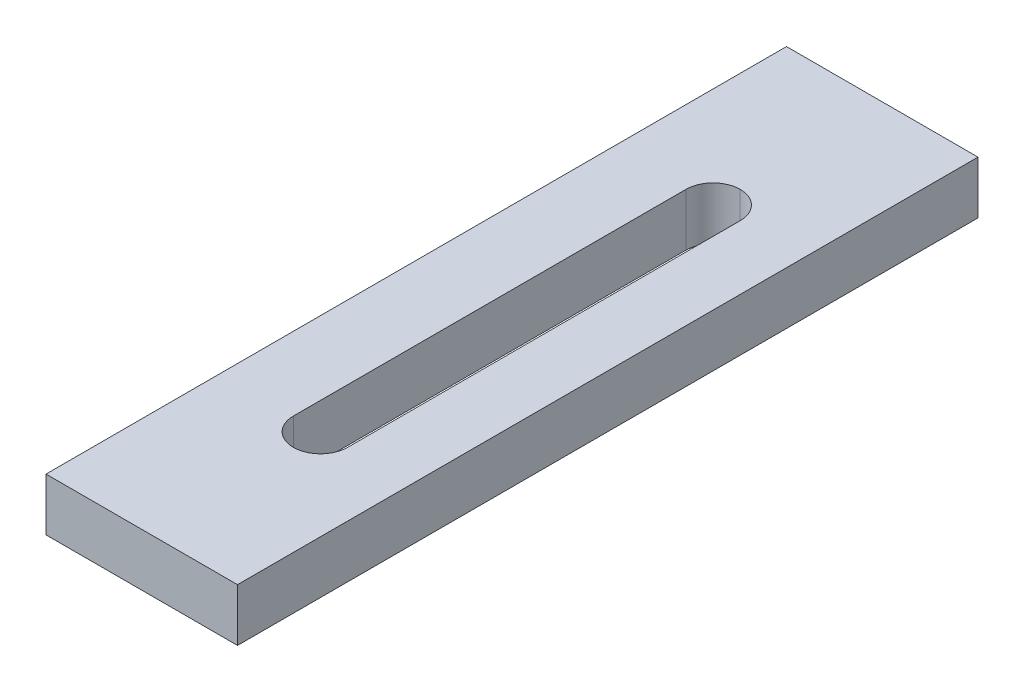
ISO-10303-21;
HEADER;
FILE_DESCRIPTION(('STEP AP214'),'2;1');
FILE_NAME('part.step','',(''),(''),'','','');
FILE_SCHEMA(('AUTOMOTIVE_DESIGN { 1 0 10303 214 1 1 1 1 }'));
ENDSEC;
DATA;
#1=APPLICATION_CONTEXT('core data for automotive mechanical design processes');
#2=APPLICATION_PROTOCOL_DEFINITION('international standard','automotive_design',2000,#1);
#3=PRODUCT_CONTEXT('',#1,'mechanical');
#4=PRODUCT('Part','Part','',(#3));
#5=PRODUCT_RELATED_PRODUCT_CATEGORY('part','',(#4));
#6=PRODUCT_DEFINITION_FORMATION('','',#4);
#7=PRODUCT_DEFINITION_CONTEXT('part definition',#1,'design');
#8=PRODUCT_DEFINITION('design','',#6,#7);
#9=PRODUCT_DEFINITION_SHAPE('','',#8);
#10=(LENGTH_UNIT() NAMED_UNIT(*) SI_UNIT(.MILLI.,.METRE.));
#11=(NAMED_UNIT(*) PLANE_ANGLE_UNIT() SI_UNIT($,.RADIAN.));
#12=(NAMED_UNIT(*) SI_UNIT($,.STERADIAN.) SOLID_ANGLE_UNIT());
#13=UNCERTAINTY_MEASURE_WITH_UNIT(LENGTH_MEASURE(1.E-05),#10,'distance_accuracy_value','');
#14=(GEOMETRIC_REPRESENTATION_CONTEXT(3) GLOBAL_UNCERTAINTY_ASSIGNED_CONTEXT((#13)) GLOBAL_UNIT_ASSIGNED_CONTEXT((#10,
#11,#12)) REPRESENTATION_CONTEXT('',''));
#15=CARTESIAN_POINT('',(0.,0.,0.));
#16=DIRECTION('',(0.,0.,1.));
#17=DIRECTION('',(1.,0.,0.));
#18=AXIS2_PLACEMENT_3D('',#15,#16,#17);
#19=CARTESIAN_POINT('',(-3.,-0.825,0.));
#20=DIRECTION('',(1.,0.,0.));
#21=DIRECTION('',(0.,0.,-1.));
#22=AXIS2_PLACEMENT_3D('',#19,#20,#21);
#23=PLANE('',#22);
#24=DIRECTION('',(0.,0.,-1.));
#25=VECTOR('',#24,1.);
#26=CARTESIAN_POINT('',(-3.,0.825,0.));
#27=LINE('',#26,#25);
#28=CARTESIAN_POINT('',(-3.,0.825,11.6));
#29=VERTEX_POINT('',#28);
#30=CARTESIAN_POINT('',(-3.,0.825,-11.6));
#31=VERTEX_POINT('',#30);
#32=EDGE_CURVE('E152',#29,#31,#27,.T.);
#33=ORIENTED_EDGE('',*,*,#32,.T.);
#34=DIRECTION('',(0.,1.,0.));
#35=VECTOR('',#34,1.);
#36=CARTESIAN_POINT('',(-3.,-0.825,-11.6));
#37=LINE('',#36,#35);
#38=CARTESIAN_POINT('',(-3.,-0.825,-11.6));
#39=VERTEX_POINT('',#38);
#40=EDGE_CURVE('E132',#39,#31,#37,.T.);
#41=ORIENTED_EDGE('',*,*,#40,.F.);
#42=DIRECTION('',(0.,0.,-1.));
#43=VECTOR('',#42,1.);
#44=CARTESIAN_POINT('',(-3.,-0.825,0.));
#45=LINE('',#44,#43);
#46=CARTESIAN_POINT('',(-3.,-0.825,11.6));
#47=VERTEX_POINT('',#46);
#48=EDGE_CURVE('E130',#47,#39,#45,.T.);
#49=ORIENTED_EDGE('',*,*,#48,.F.);
#50=DIRECTION('',(0.,1.,0.));
#51=VECTOR('',#50,1.);
#52=CARTESIAN_POINT('',(-3.,-0.825,11.6));
#53=LINE('',#52,#51);
#54=EDGE_CURVE('E115',#47,#29,#53,.T.);
#55=ORIENTED_EDGE('',*,*,#54,.T.);
#56=EDGE_LOOP('',(#33,#41,#49,#55));
#57=FACE_BOUND('',#56,.T.);
#58=ADVANCED_FACE('F37',(#57),#23,.F.);
#59=CARTESIAN_POINT('',(0.,-0.825,-11.6));
#60=DIRECTION('',(0.,0.,1.));
#61=DIRECTION('',(1.,0.,0.));
#62=AXIS2_PLACEMENT_3D('',#59,#60,#61);
#63=PLANE('',#62);
#64=DIRECTION('',(1.,0.,0.));
#65=VECTOR('',#64,1.);
#66=CARTESIAN_POINT('',(0.,0.825,-11.6));
#67=LINE('',#66,#65);
#68=CARTESIAN_POINT('',(3.,0.825,-11.6));
#69=VERTEX_POINT('',#68);
#70=EDGE_CURVE('E158',#31,#69,#67,.T.);
#71=ORIENTED_EDGE('',*,*,#70,.T.);
#72=DIRECTION('',(0.,1.,0.));
#73=VECTOR('',#72,1.);
#74=CARTESIAN_POINT('',(3.,-0.825,-11.6));
#75=LINE('',#74,#73);
#76=CARTESIAN_POINT('',(3.,-0.825,-11.6));
#77=VERTEX_POINT('',#76);
#78=EDGE_CURVE('E164',#77,#69,#75,.T.);
#79=ORIENTED_EDGE('',*,*,#78,.F.);
#80=DIRECTION('',(1.,0.,0.));
#81=VECTOR('',#80,1.);
#82=CARTESIAN_POINT('',(0.,-0.825,-11.6));
#83=LINE('',#82,#81);
#84=EDGE_CURVE('E126',#39,#77,#83,.T.);
#85=ORIENTED_EDGE('',*,*,#84,.F.);
#86=ORIENTED_EDGE('',*,*,#40,.T.);
#87=EDGE_LOOP('',(#71,#79,#85,#86));
#88=FACE_BOUND('',#87,.T.);
#89=ADVANCED_FACE('F225',(#88),#63,.F.);
#90=CARTESIAN_POINT('',(3.,-0.825,0.));
#91=DIRECTION('',(1.,0.,0.));
#92=DIRECTION('',(0.,0.,-1.));
#93=AXIS2_PLACEMENT_3D('',#90,#91,#92);
#94=PLANE('',#93);
#95=DIRECTION('',(0.,0.,-1.));
#96=VECTOR('',#95,1.);
#97=CARTESIAN_POINT('',(3.,0.825,0.));
#98=LINE('',#97,#96);
#99=CARTESIAN_POINT('',(3.,0.825,11.6));
#100=VERTEX_POINT('',#99);
#101=EDGE_CURVE('E155',#100,#69,#98,.T.);
#102=ORIENTED_EDGE('',*,*,#101,.F.);
#103=DIRECTION('',(0.,1.,0.));
#104=VECTOR('',#103,1.);
#105=CARTESIAN_POINT('',(3.,-0.825,11.6));
#106=LINE('',#105,#104);
#107=CARTESIAN_POINT('',(3.,-0.825,11.6));
#108=VERTEX_POINT('',#107);
#109=EDGE_CURVE('E125',#108,#100,#106,.T.);
#110=ORIENTED_EDGE('',*,*,#109,.F.);
#111=DIRECTION('',(0.,0.,-1.));
#112=VECTOR('',#111,1.);
#113=CARTESIAN_POINT('',(3.,-0.825,0.));
#114=LINE('',#113,#112);
#115=EDGE_CURVE('E139',#108,#77,#114,.T.);
#116=ORIENTED_EDGE('',*,*,#115,.T.);
#117=ORIENTED_EDGE('',*,*,#78,.T.);
#118=EDGE_LOOP('',(#102,#110,#116,#117));
#119=FACE_BOUND('',#118,.T.);
#120=ADVANCED_FACE('F230',(#119),#94,.T.);
#121=CARTESIAN_POINT('',(-0.699999999999986,-0.825,0.));
#122=DIRECTION('',(-1.,0.,0.));
#123=DIRECTION('',(0.,0.,1.));
#124=AXIS2_PLACEMENT_3D('',#121,#122,#123);
#125=PLANE('',#124);
#126=DIRECTION('',(0.,0.,1.));
#127=VECTOR('',#126,1.);
#128=CARTESIAN_POINT('',(-0.699999999999986,0.825,0.));
#129=LINE('',#128,#127);
#130=CARTESIAN_POINT('',(-0.699999999999986,0.825,-6.15));
#131=VERTEX_POINT('',#130);
#132=CARTESIAN_POINT('',(-0.699999999999986,0.825,6.15));
#133=VERTEX_POINT('',#132);
#134=EDGE_CURVE('E148',#131,#133,#129,.T.);
#135=ORIENTED_EDGE('',*,*,#134,.T.);
#136=DIRECTION('',(0.,1.,0.));
#137=VECTOR('',#136,1.);
#138=CARTESIAN_POINT('',(-0.699999999999986,-0.825,6.15));
#139=LINE('',#138,#137);
#140=CARTESIAN_POINT('',(-0.699999999999986,-0.825,6.15));
#141=VERTEX_POINT('',#140);
#142=EDGE_CURVE('E168',#133,#141,#139,.F.);
#143=ORIENTED_EDGE('',*,*,#142,.T.);
#144=DIRECTION('',(0.,0.,1.));
#145=VECTOR('',#144,1.);
#146=CARTESIAN_POINT('',(-0.699999999999986,-0.825,0.));
#147=LINE('',#146,#145);
#148=CARTESIAN_POINT('',(-0.699999999999986,-0.825,-6.15));
#149=VERTEX_POINT('',#148);
#150=EDGE_CURVE('E134',#149,#141,#147,.T.);
#151=ORIENTED_EDGE('',*,*,#150,.F.);
#152=DIRECTION('',(0.,1.,0.));
#153=VECTOR('',#152,1.);
#154=CARTESIAN_POINT('',(-0.699999999999986,-0.825,-6.15));
#155=LINE('',#154,#153);
#156=EDGE_CURVE('E163',#149,#131,#155,.T.);
#157=ORIENTED_EDGE('',*,*,#156,.T.);
#158=EDGE_LOOP('',(#135,#143,#151,#157));
#159=FACE_BOUND('',#158,.T.);
#160=ADVANCED_FACE('F201',(#159),#125,.F.);
#161=CARTESIAN_POINT('',(1.00000000000001,-0.825,0.));
#162=DIRECTION('',(-1.,0.,0.));
#163=DIRECTION('',(0.,0.,1.));
#164=AXIS2_PLACEMENT_3D('',#161,#162,#163);
#165=PLANE('',#164);
#166=DIRECTION('',(0.,0.,1.));
#167=VECTOR('',#166,1.);
#168=CARTESIAN_POINT('',(1.00000000000001,-0.825,0.));
#169=LINE('',#168,#167);
#170=CARTESIAN_POINT('',(1.00000000000001,-0.825,-6.15));
#171=VERTEX_POINT('',#170);
#172=CARTESIAN_POINT('',(1.00000000000001,-0.825,6.15));
#173=VERTEX_POINT('',#172);
#174=EDGE_CURVE('E161',#171,#173,#169,.T.);
#175=ORIENTED_EDGE('',*,*,#174,.T.);
#176=DIRECTION('',(0.,1.,0.));
#177=VECTOR('',#176,1.);
#178=CARTESIAN_POINT('',(1.00000000000001,-0.825,6.15));
#179=LINE('',#178,#177);
#180=CARTESIAN_POINT('',(1.00000000000001,0.825,6.15));
#181=VERTEX_POINT('',#180);
#182=EDGE_CURVE('E174',#173,#181,#179,.T.);
#183=ORIENTED_EDGE('',*,*,#182,.T.);
#184=DIRECTION('',(0.,0.,1.));
#185=VECTOR('',#184,1.);
#186=CARTESIAN_POINT('',(1.00000000000001,0.825,0.));
#187=LINE('',#186,#185);
#188=CARTESIAN_POINT('',(1.00000000000001,0.825,-6.15));
#189=VERTEX_POINT('',#188);
#190=EDGE_CURVE('E145',#189,#181,#187,.T.);
#191=ORIENTED_EDGE('',*,*,#190,.F.);
#192=DIRECTION('',(0.,1.,0.));
#193=VECTOR('',#192,1.);
#194=CARTESIAN_POINT('',(1.00000000000001,-0.825,-6.15));
#195=LINE('',#194,#193);
#196=EDGE_CURVE('E171',#189,#171,#195,.F.);
#197=ORIENTED_EDGE('',*,*,#196,.T.);
#198=EDGE_LOOP('',(#175,#183,#191,#197));
#199=FACE_BOUND('',#198,.T.);
#200=ADVANCED_FACE('F207',(#199),#165,.T.);
#201=CARTESIAN_POINT('',(0.,-0.825,11.6));
#202=DIRECTION('',(0.,0.,1.));
#203=DIRECTION('',(1.,0.,0.));
#204=AXIS2_PLACEMENT_3D('',#201,#202,#203);
#205=PLANE('',#204);
#206=DIRECTION('',(1.,0.,0.));
#207=VECTOR('',#206,1.);
#208=CARTESIAN_POINT('',(0.,0.825,11.6));
#209=LINE('',#208,#207);
#210=EDGE_CURVE('E121',#29,#100,#209,.T.);
#211=ORIENTED_EDGE('',*,*,#210,.F.);
#212=ORIENTED_EDGE('',*,*,#54,.F.);
#213=DIRECTION('',(1.,0.,0.));
#214=VECTOR('',#213,1.);
#215=CARTESIAN_POINT('',(0.,-0.825,11.6));
#216=LINE('',#215,#214);
#217=EDGE_CURVE('E119',#47,#108,#216,.T.);
#218=ORIENTED_EDGE('',*,*,#217,.T.);
#219=ORIENTED_EDGE('',*,*,#109,.T.);
#220=EDGE_LOOP('',(#211,#212,#218,#219));
#221=FACE_BOUND('',#220,.T.);
#222=ADVANCED_FACE('F117',(#221),#205,.T.);
#223=CARTESIAN_POINT('',(0.,-0.825,0.));
#224=DIRECTION('',(0.,1.,0.));
#225=DIRECTION('',(0.,0.,1.));
#226=AXIS2_PLACEMENT_3D('',#223,#224,#225);
#227=PLANE('',#226);
#228=CARTESIAN_POINT('',(0.150000000000014,-0.825,-6.15));
#229=DIRECTION('',(0.,1.,0.));
#230=DIRECTION('',(0.,0.,1.));
#231=AXIS2_PLACEMENT_3D('',#228,#229,#230);
#232=CIRCLE('',#231,0.85);
#233=CARTESIAN_POINT('',(0.150000000000014,-0.825,-7.));
#234=VERTEX_POINT('',#233);
#235=EDGE_CURVE('E53',#171,#234,#232,.T.);
#236=ORIENTED_EDGE('',*,*,#235,.T.);
#237=CARTESIAN_POINT('',(0.150000000000014,-0.825,-6.15));
#238=DIRECTION('',(0.,1.,0.));
#239=DIRECTION('',(0.,0.,1.));
#240=AXIS2_PLACEMENT_3D('',#237,#238,#239);
#241=CIRCLE('',#240,0.85);
#242=EDGE_CURVE('E11',#234,#149,#241,.T.);
#243=ORIENTED_EDGE('',*,*,#242,.T.);
#244=ORIENTED_EDGE('',*,*,#150,.T.);
#245=CARTESIAN_POINT('',(0.150000000000014,-0.825,6.15));
#246=DIRECTION('',(0.,1.,0.));
#247=DIRECTION('',(0.,0.,1.));
#248=AXIS2_PLACEMENT_3D('',#245,#246,#247);
#249=CIRCLE('',#248,0.85);
#250=CARTESIAN_POINT('',(0.150000000000014,-0.825,7.));
#251=VERTEX_POINT('',#250);
#252=EDGE_CURVE('E178',#141,#251,#249,.T.);
#253=ORIENTED_EDGE('',*,*,#252,.T.);
#254=CARTESIAN_POINT('',(0.150000000000014,-0.825,6.15));
#255=DIRECTION('',(0.,1.,0.));
#256=DIRECTION('',(0.,0.,1.));
#257=AXIS2_PLACEMENT_3D('',#254,#255,#256);
#258=CIRCLE('',#257,0.85);
#259=EDGE_CURVE('E182',#251,#173,#258,.T.);
#260=ORIENTED_EDGE('',*,*,#259,.T.);
#261=ORIENTED_EDGE('',*,*,#174,.F.);
#262=EDGE_LOOP('',(#236,#243,#244,#253,#260,#261));
#263=FACE_BOUND('',#262,.T.);
#264=ORIENTED_EDGE('',*,*,#48,.T.);
#265=ORIENTED_EDGE('',*,*,#84,.T.);
#266=ORIENTED_EDGE('',*,*,#115,.F.);
#267=ORIENTED_EDGE('',*,*,#217,.F.);
#268=EDGE_LOOP('',(#264,#265,#266,#267));
#269=FACE_BOUND('',#268,.T.);
#270=ADVANCED_FACE('F137',(#263,#269),#227,.F.);
#271=CARTESIAN_POINT('',(0.,0.825,0.));
#272=DIRECTION('',(0.,1.,0.));
#273=DIRECTION('',(0.,0.,1.));
#274=AXIS2_PLACEMENT_3D('',#271,#272,#273);
#275=PLANE('',#274);
#276=ORIENTED_EDGE('',*,*,#134,.F.);
#277=CARTESIAN_POINT('',(0.150000000000014,0.825,-6.15));
#278=DIRECTION('',(0.,1.,0.));
#279=DIRECTION('',(0.,0.,1.));
#280=AXIS2_PLACEMENT_3D('',#277,#278,#279);
#281=CIRCLE('',#280,0.85);
#282=CARTESIAN_POINT('',(0.150000000000014,0.825,-7.));
#283=VERTEX_POINT('',#282);
#284=EDGE_CURVE('E46',#131,#283,#281,.F.);
#285=ORIENTED_EDGE('',*,*,#284,.T.);
#286=CARTESIAN_POINT('',(0.150000000000014,0.825,-6.15));
#287=DIRECTION('',(0.,1.,0.));
#288=DIRECTION('',(0.,0.,1.));
#289=AXIS2_PLACEMENT_3D('',#286,#287,#288);
#290=CIRCLE('',#289,0.85);
#291=EDGE_CURVE('E184',#283,#189,#290,.F.);
#292=ORIENTED_EDGE('',*,*,#291,.T.);
#293=ORIENTED_EDGE('',*,*,#190,.T.);
#294=CARTESIAN_POINT('',(0.150000000000014,0.825,6.15));
#295=DIRECTION('',(0.,1.,0.));
#296=DIRECTION('',(0.,0.,1.));
#297=AXIS2_PLACEMENT_3D('',#294,#295,#296);
#298=CIRCLE('',#297,0.85);
#299=CARTESIAN_POINT('',(0.150000000000014,0.825,7.));
#300=VERTEX_POINT('',#299);
#301=EDGE_CURVE('E180',#181,#300,#298,.F.);
#302=ORIENTED_EDGE('',*,*,#301,.T.);
#303=CARTESIAN_POINT('',(0.150000000000014,0.825,6.15));
#304=DIRECTION('',(0.,1.,0.));
#305=DIRECTION('',(0.,0.,1.));
#306=AXIS2_PLACEMENT_3D('',#303,#304,#305);
#307=CIRCLE('',#306,0.85);
#308=EDGE_CURVE('E176',#300,#133,#307,.F.);
#309=ORIENTED_EDGE('',*,*,#308,.T.);
#310=EDGE_LOOP('',(#276,#285,#292,#293,#302,#309));
#311=FACE_BOUND('',#310,.T.);
#312=ORIENTED_EDGE('',*,*,#32,.F.);
#313=ORIENTED_EDGE('',*,*,#210,.T.);
#314=ORIENTED_EDGE('',*,*,#101,.T.);
#315=ORIENTED_EDGE('',*,*,#70,.F.);
#316=EDGE_LOOP('',(#312,#313,#314,#315));
#317=FACE_BOUND('',#316,.T.);
#318=ADVANCED_FACE('F213',(#311,#317),#275,.T.);
#319=CARTESIAN_POINT('',(0.150000000000014,-0.825,6.15));
#320=DIRECTION('',(0.,1.,0.));
#321=DIRECTION('',(0.,0.,1.));
#322=AXIS2_PLACEMENT_3D('',#319,#320,#321);
#323=CYLINDRICAL_SURFACE('',#322,0.85);
#324=ORIENTED_EDGE('',*,*,#182,.F.);
#325=ORIENTED_EDGE('',*,*,#259,.F.);
#326=DIRECTION('',(0.,1.,0.));
#327=VECTOR('',#326,1.);
#328=CARTESIAN_POINT('',(0.150000000000014,-0.825,7.));
#329=LINE('',#328,#327);
#330=EDGE_CURVE('E149',#300,#251,#329,.F.);
#331=ORIENTED_EDGE('',*,*,#330,.F.);
#332=ORIENTED_EDGE('',*,*,#301,.F.);
#333=EDGE_LOOP('',(#324,#325,#331,#332));
#334=FACE_BOUND('',#333,.T.);
#335=ADVANCED_FACE('F212',(#334),#323,.F.);
#336=CARTESIAN_POINT('',(0.150000000000014,-0.825,6.15));
#337=DIRECTION('',(0.,-1.,0.));
#338=DIRECTION('',(0.,0.,-1.));
#339=AXIS2_PLACEMENT_3D('',#336,#337,#338);
#340=CYLINDRICAL_SURFACE('',#339,0.85);
#341=ORIENTED_EDGE('',*,*,#252,.F.);
#342=ORIENTED_EDGE('',*,*,#142,.F.);
#343=ORIENTED_EDGE('',*,*,#308,.F.);
#344=ORIENTED_EDGE('',*,*,#330,.T.);
#345=EDGE_LOOP('',(#341,#342,#343,#344));
#346=FACE_BOUND('',#345,.T.);
#347=ADVANCED_FACE('F215',(#346),#340,.F.);
#348=CARTESIAN_POINT('',(0.150000000000014,-0.825,-6.15));
#349=DIRECTION('',(0.,1.,0.));
#350=DIRECTION('',(0.,0.,1.));
#351=AXIS2_PLACEMENT_3D('',#348,#349,#350);
#352=CYLINDRICAL_SURFACE('',#351,0.85);
#353=ORIENTED_EDGE('',*,*,#156,.F.);
#354=ORIENTED_EDGE('',*,*,#242,.F.);
#355=DIRECTION('',(0.,1.,0.));
#356=VECTOR('',#355,1.);
#357=CARTESIAN_POINT('',(0.150000000000014,-0.825,-7.));
#358=LINE('',#357,#356);
#359=EDGE_CURVE('E41',#283,#234,#358,.F.);
#360=ORIENTED_EDGE('',*,*,#359,.F.);
#361=ORIENTED_EDGE('',*,*,#284,.F.);
#362=EDGE_LOOP('',(#353,#354,#360,#361));
#363=FACE_BOUND('',#362,.T.);
#364=ADVANCED_FACE('F39',(#363),#352,.F.);
#365=CARTESIAN_POINT('',(0.150000000000014,-0.825,-6.15));
#366=DIRECTION('',(0.,-1.,0.));
#367=DIRECTION('',(0.,0.,-1.));
#368=AXIS2_PLACEMENT_3D('',#365,#366,#367);
#369=CYLINDRICAL_SURFACE('',#368,0.85);
#370=ORIENTED_EDGE('',*,*,#235,.F.);
#371=ORIENTED_EDGE('',*,*,#196,.F.);
#372=ORIENTED_EDGE('',*,*,#291,.F.);
#373=ORIENTED_EDGE('',*,*,#359,.T.);
#374=EDGE_LOOP('',(#370,#371,#372,#373));
#375=FACE_BOUND('',#374,.T.);
#376=ADVANCED_FACE('F194',(#375),#369,.F.);
#377=CLOSED_SHELL('',(#58,#89,#120,#160,#200,#222,#270,#318,#335,#347,#364,#376));
#378=MANIFOLD_SOLID_BREP('B2',#377);
#379=ADVANCED_BREP_SHAPE_REPRESENTATION('',(#18,#378),#14);
#380=SHAPE_DEFINITION_REPRESENTATION(#9,#379);
ENDSEC;
END-ISO-10303-21;
